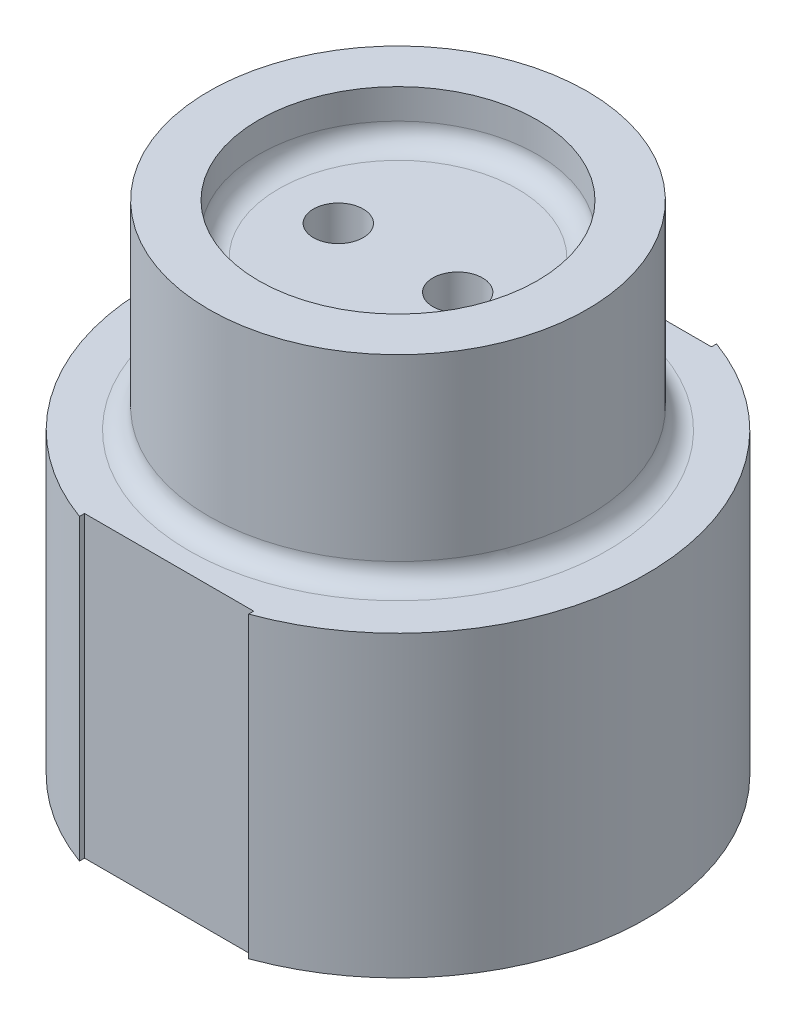
ISO-10303-21;
HEADER;
FILE_DESCRIPTION(('STEP AP214'),'2;1');
FILE_NAME('part.step','',(''),(''),'','','');
FILE_SCHEMA(('AUTOMOTIVE_DESIGN { 1 0 10303 214 1 1 1 1 }'));
ENDSEC;
DATA;
#1=APPLICATION_CONTEXT('core data for automotive mechanical design processes');
#2=APPLICATION_PROTOCOL_DEFINITION('international standard','automotive_design',2000,#1);
#3=PRODUCT_CONTEXT('',#1,'mechanical');
#4=PRODUCT('Part','Part','',(#3));
#5=PRODUCT_RELATED_PRODUCT_CATEGORY('part','',(#4));
#6=PRODUCT_DEFINITION_FORMATION('','',#4);
#7=PRODUCT_DEFINITION_CONTEXT('part definition',#1,'design');
#8=PRODUCT_DEFINITION('design','',#6,#7);
#9=PRODUCT_DEFINITION_SHAPE('','',#8);
#10=(LENGTH_UNIT() NAMED_UNIT(*) SI_UNIT(.MILLI.,.METRE.));
#11=(NAMED_UNIT(*) PLANE_ANGLE_UNIT() SI_UNIT($,.RADIAN.));
#12=(NAMED_UNIT(*) SI_UNIT($,.STERADIAN.) SOLID_ANGLE_UNIT());
#13=UNCERTAINTY_MEASURE_WITH_UNIT(LENGTH_MEASURE(1.E-05),#10,'distance_accuracy_value','');
#14=(GEOMETRIC_REPRESENTATION_CONTEXT(3) GLOBAL_UNCERTAINTY_ASSIGNED_CONTEXT((#13)) GLOBAL_UNIT_ASSIGNED_CONTEXT((#10,
#11,#12)) REPRESENTATION_CONTEXT('',''));
#15=CARTESIAN_POINT('',(0.,0.,0.));
#16=DIRECTION('',(0.,0.,1.));
#17=DIRECTION('',(1.,0.,0.));
#18=AXIS2_PLACEMENT_3D('',#15,#16,#17);
#19=CARTESIAN_POINT('',(0.,0.,0.));
#20=DIRECTION('',(0.,1.,0.));
#21=DIRECTION('',(0.,0.,1.));
#22=AXIS2_PLACEMENT_3D('',#19,#20,#21);
#23=PLANE('',#22);
#24=CARTESIAN_POINT('',(33.02,0.,0.));
#25=DIRECTION('',(0.,1.,0.));
#26=DIRECTION('',(0.,0.,1.));
#27=AXIS2_PLACEMENT_3D('',#24,#25,#26);
#28=CIRCLE('',#27,6.35);
#29=CARTESIAN_POINT('',(33.02,0.,6.35));
#30=VERTEX_POINT('',#29);
#31=EDGE_CURVE('E179',#30,#30,#28,.T.);
#32=ORIENTED_EDGE('',*,*,#31,.T.);
#33=EDGE_LOOP('',(#32));
#34=FACE_BOUND('',#33,.T.);
#35=CARTESIAN_POINT('',(-33.02,0.,0.));
#36=DIRECTION('',(0.,-1.,0.));
#37=DIRECTION('',(0.,0.,1.));
#38=AXIS2_PLACEMENT_3D('',#35,#36,#37);
#39=CIRCLE('',#38,6.35);
#40=CARTESIAN_POINT('',(-33.02,0.,6.35));
#41=VERTEX_POINT('',#40);
#42=EDGE_CURVE('E161',#41,#41,#39,.T.);
#43=ORIENTED_EDGE('',*,*,#42,.F.);
#44=EDGE_LOOP('',(#43));
#45=FACE_BOUND('',#44,.T.);
#46=DIRECTION('',(0.,0.,-1.));
#47=VECTOR('',#46,1.);
#48=CARTESIAN_POINT('',(-21.59,0.,-58.42));
#49=LINE('',#48,#47);
#50=CARTESIAN_POINT('',(-21.59,0.,-58.42));
#51=VERTEX_POINT('',#50);
#52=CARTESIAN_POINT('',(-21.59,0.,-59.7170151631844));
#53=VERTEX_POINT('',#52);
#54=EDGE_CURVE('E125',#51,#53,#49,.T.);
#55=ORIENTED_EDGE('',*,*,#54,.F.);
#56=DIRECTION('',(1.,0.,0.));
#57=VECTOR('',#56,1.);
#58=CARTESIAN_POINT('',(-21.59,0.,-58.42));
#59=LINE('',#58,#57);
#60=CARTESIAN_POINT('',(21.59,0.,-58.42));
#61=VERTEX_POINT('',#60);
#62=EDGE_CURVE('E110',#51,#61,#59,.T.);
#63=ORIENTED_EDGE('',*,*,#62,.T.);
#64=DIRECTION('',(0.,0.,-1.));
#65=VECTOR('',#64,1.);
#66=CARTESIAN_POINT('',(21.59,0.,-58.42));
#67=LINE('',#66,#65);
#68=CARTESIAN_POINT('',(21.59,0.,-59.7170151631844));
#69=VERTEX_POINT('',#68);
#70=EDGE_CURVE('E108',#61,#69,#67,.T.);
#71=ORIENTED_EDGE('',*,*,#70,.T.);
#72=CARTESIAN_POINT('',(0.,0.,0.));
#73=DIRECTION('',(0.,1.,0.));
#74=DIRECTION('',(0.,0.,1.));
#75=AXIS2_PLACEMENT_3D('',#72,#73,#74);
#76=CIRCLE('',#75,63.5);
#77=CARTESIAN_POINT('',(21.59,0.,59.7170151631844));
#78=VERTEX_POINT('',#77);
#79=EDGE_CURVE('E217',#78,#69,#76,.T.);
#80=ORIENTED_EDGE('',*,*,#79,.F.);
#81=DIRECTION('',(0.,0.,1.));
#82=VECTOR('',#81,1.);
#83=CARTESIAN_POINT('',(21.59,0.,58.42));
#84=LINE('',#83,#82);
#85=CARTESIAN_POINT('',(21.59,0.,58.42));
#86=VERTEX_POINT('',#85);
#87=EDGE_CURVE('E149',#86,#78,#84,.T.);
#88=ORIENTED_EDGE('',*,*,#87,.F.);
#89=DIRECTION('',(1.,0.,0.));
#90=VECTOR('',#89,1.);
#91=CARTESIAN_POINT('',(-21.59,0.,58.42));
#92=LINE('',#91,#90);
#93=CARTESIAN_POINT('',(-21.59,0.,58.42));
#94=VERTEX_POINT('',#93);
#95=EDGE_CURVE('E137',#94,#86,#92,.T.);
#96=ORIENTED_EDGE('',*,*,#95,.F.);
#97=DIRECTION('',(0.,0.,1.));
#98=VECTOR('',#97,1.);
#99=CARTESIAN_POINT('',(-21.59,0.,58.42));
#100=LINE('',#99,#98);
#101=CARTESIAN_POINT('',(-21.59,0.,59.7170151631844));
#102=VERTEX_POINT('',#101);
#103=EDGE_CURVE('E142',#94,#102,#100,.T.);
#104=ORIENTED_EDGE('',*,*,#103,.T.);
#105=EDGE_CURVE('E216',#53,#102,#76,.T.);
#106=ORIENTED_EDGE('',*,*,#105,.F.);
#107=EDGE_LOOP('',(#55,#63,#71,#80,#88,#96,#104,#106));
#108=FACE_BOUND('',#107,.T.);
#109=ADVANCED_FACE('F35',(#34,#45,#108),#23,.F.);
#110=CARTESIAN_POINT('',(0.,12.7,0.));
#111=DIRECTION('',(0.,1.,0.));
#112=DIRECTION('',(0.,0.,1.));
#113=AXIS2_PLACEMENT_3D('',#110,#111,#112);
#114=CYLINDRICAL_SURFACE('',#113,63.5);
#115=DIRECTION('',(0.,1.,0.));
#116=VECTOR('',#115,1.);
#117=CARTESIAN_POINT('',(-21.59,12.7,-59.7170151631844));
#118=LINE('',#117,#116);
#119=CARTESIAN_POINT('',(-21.59,76.2,-59.7170151631844));
#120=VERTEX_POINT('',#119);
#121=EDGE_CURVE('E132',#53,#120,#118,.T.);
#122=ORIENTED_EDGE('',*,*,#121,.F.);
#123=ORIENTED_EDGE('',*,*,#105,.T.);
#124=DIRECTION('',(0.,1.,0.));
#125=VECTOR('',#124,1.);
#126=CARTESIAN_POINT('',(-21.59,12.7,59.7170151631844));
#127=LINE('',#126,#125);
#128=CARTESIAN_POINT('',(-21.59,76.2,59.7170151631844));
#129=VERTEX_POINT('',#128);
#130=EDGE_CURVE('E155',#102,#129,#127,.T.);
#131=ORIENTED_EDGE('',*,*,#130,.T.);
#132=CARTESIAN_POINT('',(0.,76.2,0.));
#133=DIRECTION('',(0.,1.,0.));
#134=DIRECTION('',(0.,0.,1.));
#135=AXIS2_PLACEMENT_3D('',#132,#133,#134);
#136=CIRCLE('',#135,63.5);
#137=EDGE_CURVE('E214',#120,#129,#136,.T.);
#138=ORIENTED_EDGE('',*,*,#137,.F.);
#139=EDGE_LOOP('',(#122,#123,#131,#138));
#140=FACE_BOUND('',#139,.T.);
#141=ADVANCED_FACE('F250',(#140),#114,.T.);
#142=DIRECTION('',(0.,1.,0.));
#143=VECTOR('',#142,1.);
#144=CARTESIAN_POINT('',(21.59,12.7,-59.7170151631844));
#145=LINE('',#144,#143);
#146=CARTESIAN_POINT('',(21.59,76.2,-59.7170151631844));
#147=VERTEX_POINT('',#146);
#148=EDGE_CURVE('E130',#147,#69,#145,.F.);
#149=ORIENTED_EDGE('',*,*,#148,.F.);
#150=CARTESIAN_POINT('',(21.59,76.2,59.7170151631844));
#151=VERTEX_POINT('',#150);
#152=EDGE_CURVE('E122',#151,#147,#136,.T.);
#153=ORIENTED_EDGE('',*,*,#152,.F.);
#154=DIRECTION('',(0.,1.,0.));
#155=VECTOR('',#154,1.);
#156=CARTESIAN_POINT('',(21.59,12.7,59.7170151631844));
#157=LINE('',#156,#155);
#158=EDGE_CURVE('E146',#151,#78,#157,.F.);
#159=ORIENTED_EDGE('',*,*,#158,.T.);
#160=ORIENTED_EDGE('',*,*,#79,.T.);
#161=EDGE_LOOP('',(#149,#153,#159,#160));
#162=FACE_BOUND('',#161,.T.);
#163=ADVANCED_FACE('F257',(#162),#114,.T.);
#164=CARTESIAN_POINT('',(63.5,76.2,0.));
#165=DIRECTION('',(0.,-1.,0.));
#166=DIRECTION('',(0.,0.,-1.));
#167=AXIS2_PLACEMENT_3D('',#164,#165,#166);
#168=PLANE('',#167);
#169=CARTESIAN_POINT('',(0.,76.2,0.));
#170=DIRECTION('',(0.,-1.,0.));
#171=DIRECTION('',(0.,0.,-1.));
#172=AXIS2_PLACEMENT_3D('',#169,#170,#171);
#173=CIRCLE('',#172,53.34);
#174=CARTESIAN_POINT('',(0.,76.2,-53.34));
#175=VERTEX_POINT('',#174);
#176=EDGE_CURVE('E11',#175,#175,#173,.T.);
#177=ORIENTED_EDGE('',*,*,#176,.T.);
#178=EDGE_LOOP('',(#177));
#179=FACE_BOUND('',#178,.T.);
#180=DIRECTION('',(0.,0.,-1.));
#181=VECTOR('',#180,1.);
#182=CARTESIAN_POINT('',(-21.59,76.2,-58.42));
#183=LINE('',#182,#181);
#184=CARTESIAN_POINT('',(-21.59,76.2,-58.42));
#185=VERTEX_POINT('',#184);
#186=EDGE_CURVE('E123',#185,#120,#183,.T.);
#187=ORIENTED_EDGE('',*,*,#186,.T.);
#188=ORIENTED_EDGE('',*,*,#137,.T.);
#189=DIRECTION('',(0.,0.,1.));
#190=VECTOR('',#189,1.);
#191=CARTESIAN_POINT('',(-21.59,76.2,58.42));
#192=LINE('',#191,#190);
#193=CARTESIAN_POINT('',(-21.59,76.2,58.42));
#194=VERTEX_POINT('',#193);
#195=EDGE_CURVE('E143',#194,#129,#192,.T.);
#196=ORIENTED_EDGE('',*,*,#195,.F.);
#197=DIRECTION('',(-1.,0.,0.));
#198=VECTOR('',#197,1.);
#199=CARTESIAN_POINT('',(-21.59,76.2,58.42));
#200=LINE('',#199,#198);
#201=CARTESIAN_POINT('',(21.59,76.2,58.42));
#202=VERTEX_POINT('',#201);
#203=EDGE_CURVE('E140',#202,#194,#200,.T.);
#204=ORIENTED_EDGE('',*,*,#203,.F.);
#205=DIRECTION('',(0.,0.,1.));
#206=VECTOR('',#205,1.);
#207=CARTESIAN_POINT('',(21.59,76.2,58.42));
#208=LINE('',#207,#206);
#209=EDGE_CURVE('E147',#202,#151,#208,.T.);
#210=ORIENTED_EDGE('',*,*,#209,.T.);
#211=ORIENTED_EDGE('',*,*,#152,.T.);
#212=DIRECTION('',(0.,0.,-1.));
#213=VECTOR('',#212,1.);
#214=CARTESIAN_POINT('',(21.59,76.2,-58.42));
#215=LINE('',#214,#213);
#216=CARTESIAN_POINT('',(21.59,76.2,-58.42));
#217=VERTEX_POINT('',#216);
#218=EDGE_CURVE('E105',#217,#147,#215,.T.);
#219=ORIENTED_EDGE('',*,*,#218,.F.);
#220=DIRECTION('',(-1.,0.,0.));
#221=VECTOR('',#220,1.);
#222=CARTESIAN_POINT('',(-21.59,76.2,-58.42));
#223=LINE('',#222,#221);
#224=EDGE_CURVE('E111',#217,#185,#223,.T.);
#225=ORIENTED_EDGE('',*,*,#224,.T.);
#226=EDGE_LOOP('',(#187,#188,#196,#204,#210,#211,#219,#225));
#227=FACE_BOUND('',#226,.T.);
#228=ADVANCED_FACE('F119',(#179,#227),#168,.F.);
#229=CARTESIAN_POINT('',(-15.24,114.3,0.));
#230=DIRECTION('',(0.,-1.,0.));
#231=DIRECTION('',(1.,0.,0.));
#232=AXIS2_PLACEMENT_3D('',#229,#230,#231);
#233=CYLINDRICAL_SURFACE('',#232,6.35);
#234=CARTESIAN_POINT('',(-15.24,50.8,0.));
#235=DIRECTION('',(-0.707106781186548,-0.707106781186548,0.));
#236=DIRECTION('',(0.707106781186548,-0.707106781186548,0.));
#237=AXIS2_PLACEMENT_3D('',#234,#235,#236);
#238=ELLIPSE('',#237,8.98025612106916,6.35);
#239=CARTESIAN_POINT('',(-8.89,44.45,0.));
#240=VERTEX_POINT('',#239);
#241=EDGE_CURVE('E165',#240,#240,#238,.F.);
#242=ORIENTED_EDGE('',*,*,#241,.F.);
#243=EDGE_LOOP('',(#242));
#244=FACE_BOUND('',#243,.T.);
#245=CARTESIAN_POINT('',(-15.24,114.3,0.));
#246=DIRECTION('',(0.,1.,0.));
#247=DIRECTION('',(0.,0.,1.));
#248=AXIS2_PLACEMENT_3D('',#245,#246,#247);
#249=CIRCLE('',#248,6.35000000000001);
#250=CARTESIAN_POINT('',(-15.24,114.3,6.35000000000001));
#251=VERTEX_POINT('',#250);
#252=EDGE_CURVE('E158',#251,#251,#249,.T.);
#253=ORIENTED_EDGE('',*,*,#252,.T.);
#254=EDGE_LOOP('',(#253));
#255=FACE_BOUND('',#254,.T.);
#256=ADVANCED_FACE('F264',(#244,#255),#233,.F.);
#257=CARTESIAN_POINT('',(-1.16999999999999,50.8,0.));
#258=DIRECTION('',(-1.,0.,0.));
#259=DIRECTION('',(0.,0.,1.));
#260=AXIS2_PLACEMENT_3D('',#257,#258,#259);
#261=CYLINDRICAL_SURFACE('',#260,6.35);
#262=ORIENTED_EDGE('',*,*,#241,.T.);
#263=EDGE_LOOP('',(#262));
#264=FACE_BOUND('',#263,.T.);
#265=CARTESIAN_POINT('',(-33.02,50.8,0.));
#266=DIRECTION('',(-0.707106781186548,-0.707106781186548,0.));
#267=DIRECTION('',(-0.707106781186548,0.707106781186548,0.));
#268=AXIS2_PLACEMENT_3D('',#265,#266,#267);
#269=ELLIPSE('',#268,8.98025612106916,6.35);
#270=CARTESIAN_POINT('',(-39.37,57.15,0.));
#271=VERTEX_POINT('',#270);
#272=EDGE_CURVE('E169',#271,#271,#269,.F.);
#273=ORIENTED_EDGE('',*,*,#272,.F.);
#274=EDGE_LOOP('',(#273));
#275=FACE_BOUND('',#274,.T.);
#276=ADVANCED_FACE('F338',(#264,#275),#261,.F.);
#277=CARTESIAN_POINT('',(-33.02,64.87,0.));
#278=DIRECTION('',(0.,-1.,0.));
#279=DIRECTION('',(0.,0.,-1.));
#280=AXIS2_PLACEMENT_3D('',#277,#278,#279);
#281=CYLINDRICAL_SURFACE('',#280,6.35);
#282=ORIENTED_EDGE('',*,*,#272,.T.);
#283=EDGE_LOOP('',(#282));
#284=FACE_BOUND('',#283,.T.);
#285=ORIENTED_EDGE('',*,*,#42,.T.);
#286=EDGE_LOOP('',(#285));
#287=FACE_BOUND('',#286,.T.);
#288=ADVANCED_FACE('F269',(#284,#287),#281,.F.);
#289=CARTESIAN_POINT('',(0.,12.7,0.));
#290=DIRECTION('',(0.,1.,0.));
#291=DIRECTION('',(0.,0.,1.));
#292=AXIS2_PLACEMENT_3D('',#289,#290,#291);
#293=CYLINDRICAL_SURFACE('',#292,48.26);
#294=CARTESIAN_POINT('',(0.,81.28,0.));
#295=DIRECTION('',(0.,-1.,0.));
#296=DIRECTION('',(0.,0.,-1.));
#297=AXIS2_PLACEMENT_3D('',#294,#295,#296);
#298=CIRCLE('',#297,48.26);
#299=CARTESIAN_POINT('',(0.,81.28,-48.26));
#300=VERTEX_POINT('',#299);
#301=EDGE_CURVE('E44',#300,#300,#298,.F.);
#302=ORIENTED_EDGE('',*,*,#301,.T.);
#303=EDGE_LOOP('',(#302));
#304=FACE_BOUND('',#303,.T.);
#305=CARTESIAN_POINT('',(0.,127.,0.));
#306=DIRECTION('',(0.,1.,0.));
#307=DIRECTION('',(0.,0.,1.));
#308=AXIS2_PLACEMENT_3D('',#305,#306,#307);
#309=CIRCLE('',#308,48.26);
#310=CARTESIAN_POINT('',(0.,127.,48.26));
#311=VERTEX_POINT('',#310);
#312=EDGE_CURVE('E211',#311,#311,#309,.T.);
#313=ORIENTED_EDGE('',*,*,#312,.F.);
#314=EDGE_LOOP('',(#313));
#315=FACE_BOUND('',#314,.T.);
#316=ADVANCED_FACE('F238',(#304,#315),#293,.T.);
#317=CARTESIAN_POINT('',(48.26,127.,0.));
#318=DIRECTION('',(0.,-1.,0.));
#319=DIRECTION('',(0.,0.,-1.));
#320=AXIS2_PLACEMENT_3D('',#317,#318,#319);
#321=PLANE('',#320);
#322=CARTESIAN_POINT('',(0.,127.,0.));
#323=DIRECTION('',(0.,1.,0.));
#324=DIRECTION('',(0.,0.,1.));
#325=AXIS2_PLACEMENT_3D('',#322,#323,#324);
#326=CIRCLE('',#325,35.56);
#327=CARTESIAN_POINT('',(0.,127.,35.56));
#328=VERTEX_POINT('',#327);
#329=EDGE_CURVE('E208',#328,#328,#326,.T.);
#330=ORIENTED_EDGE('',*,*,#329,.F.);
#331=EDGE_LOOP('',(#330));
#332=FACE_BOUND('',#331,.T.);
#333=ORIENTED_EDGE('',*,*,#312,.T.);
#334=EDGE_LOOP('',(#333));
#335=FACE_BOUND('',#334,.T.);
#336=ADVANCED_FACE('F268',(#332,#335),#321,.F.);
#337=CARTESIAN_POINT('',(0.,12.7,0.));
#338=DIRECTION('',(0.,1.,0.));
#339=DIRECTION('',(0.,0.,1.));
#340=AXIS2_PLACEMENT_3D('',#337,#338,#339);
#341=CYLINDRICAL_SURFACE('',#340,35.56);
#342=CARTESIAN_POINT('',(0.,119.38,0.));
#343=DIRECTION('',(0.,1.,0.));
#344=DIRECTION('',(0.,0.,1.));
#345=AXIS2_PLACEMENT_3D('',#342,#343,#344);
#346=CIRCLE('',#345,35.56);
#347=CARTESIAN_POINT('',(0.,119.38,35.56));
#348=VERTEX_POINT('',#347);
#349=EDGE_CURVE('E233',#348,#348,#346,.F.);
#350=ORIENTED_EDGE('',*,*,#349,.T.);
#351=EDGE_LOOP('',(#350));
#352=FACE_BOUND('',#351,.T.);
#353=ORIENTED_EDGE('',*,*,#329,.T.);
#354=EDGE_LOOP('',(#353));
#355=FACE_BOUND('',#354,.T.);
#356=ADVANCED_FACE('F272',(#352,#355),#341,.F.);
#357=CARTESIAN_POINT('',(0.,114.3,0.));
#358=DIRECTION('',(0.,1.,0.));
#359=DIRECTION('',(0.,0.,1.));
#360=AXIS2_PLACEMENT_3D('',#357,#358,#359);
#361=PLANE('',#360);
#362=CARTESIAN_POINT('',(0.,114.3,0.));
#363=DIRECTION('',(0.,1.,0.));
#364=DIRECTION('',(0.,0.,1.));
#365=AXIS2_PLACEMENT_3D('',#362,#363,#364);
#366=CIRCLE('',#365,30.48);
#367=CARTESIAN_POINT('',(0.,114.3,30.48));
#368=VERTEX_POINT('',#367);
#369=EDGE_CURVE('E230',#368,#368,#366,.T.);
#370=ORIENTED_EDGE('',*,*,#369,.T.);
#371=EDGE_LOOP('',(#370));
#372=FACE_BOUND('',#371,.T.);
#373=ORIENTED_EDGE('',*,*,#252,.F.);
#374=EDGE_LOOP('',(#373));
#375=FACE_BOUND('',#374,.T.);
#376=CARTESIAN_POINT('',(15.24,114.3,0.));
#377=DIRECTION('',(0.,1.,0.));
#378=DIRECTION('',(0.,0.,1.));
#379=AXIS2_PLACEMENT_3D('',#376,#377,#378);
#380=CIRCLE('',#379,6.35000000000001);
#381=CARTESIAN_POINT('',(15.24,114.3,6.35000000000001));
#382=VERTEX_POINT('',#381);
#383=EDGE_CURVE('E168',#382,#382,#380,.F.);
#384=ORIENTED_EDGE('',*,*,#383,.T.);
#385=EDGE_LOOP('',(#384));
#386=FACE_BOUND('',#385,.T.);
#387=ADVANCED_FACE('F276',(#372,#375,#386),#361,.T.);
#388=CARTESIAN_POINT('',(33.02,64.87,0.));
#389=DIRECTION('',(0.,-1.,0.));
#390=DIRECTION('',(0.,0.,-1.));
#391=AXIS2_PLACEMENT_3D('',#388,#389,#390);
#392=CYLINDRICAL_SURFACE('',#391,6.35);
#393=CARTESIAN_POINT('',(33.02,50.8,0.));
#394=DIRECTION('',(0.707106781186548,-0.707106781186548,0.));
#395=DIRECTION('',(0.707106781186548,0.707106781186548,0.));
#396=AXIS2_PLACEMENT_3D('',#393,#394,#395);
#397=ELLIPSE('',#396,8.98025612106916,6.35);
#398=CARTESIAN_POINT('',(39.37,57.15,0.));
#399=VERTEX_POINT('',#398);
#400=EDGE_CURVE('E187',#399,#399,#397,.F.);
#401=ORIENTED_EDGE('',*,*,#400,.T.);
#402=EDGE_LOOP('',(#401));
#403=FACE_BOUND('',#402,.T.);
#404=ORIENTED_EDGE('',*,*,#31,.F.);
#405=EDGE_LOOP('',(#404));
#406=FACE_BOUND('',#405,.T.);
#407=ADVANCED_FACE('F295',(#403,#406),#392,.F.);
#408=CARTESIAN_POINT('',(1.16999999999999,50.8,0.));
#409=DIRECTION('',(1.,0.,0.));
#410=DIRECTION('',(0.,0.,-1.));
#411=AXIS2_PLACEMENT_3D('',#408,#409,#410);
#412=CYLINDRICAL_SURFACE('',#411,6.35);
#413=CARTESIAN_POINT('',(15.24,50.8,0.));
#414=DIRECTION('',(0.707106781186548,-0.707106781186548,0.));
#415=DIRECTION('',(-0.707106781186548,-0.707106781186548,0.));
#416=AXIS2_PLACEMENT_3D('',#413,#414,#415);
#417=ELLIPSE('',#416,8.98025612106916,6.35);
#418=CARTESIAN_POINT('',(8.89,44.45,0.));
#419=VERTEX_POINT('',#418);
#420=EDGE_CURVE('E183',#419,#419,#417,.F.);
#421=ORIENTED_EDGE('',*,*,#420,.T.);
#422=EDGE_LOOP('',(#421));
#423=FACE_BOUND('',#422,.T.);
#424=ORIENTED_EDGE('',*,*,#400,.F.);
#425=EDGE_LOOP('',(#424));
#426=FACE_BOUND('',#425,.T.);
#427=ADVANCED_FACE('F315',(#423,#426),#412,.F.);
#428=CARTESIAN_POINT('',(15.24,114.3,0.));
#429=DIRECTION('',(0.,-1.,0.));
#430=DIRECTION('',(1.,0.,0.));
#431=AXIS2_PLACEMENT_3D('',#428,#429,#430);
#432=CYLINDRICAL_SURFACE('',#431,6.35);
#433=ORIENTED_EDGE('',*,*,#420,.F.);
#434=EDGE_LOOP('',(#433));
#435=FACE_BOUND('',#434,.T.);
#436=ORIENTED_EDGE('',*,*,#383,.F.);
#437=EDGE_LOOP('',(#436));
#438=FACE_BOUND('',#437,.T.);
#439=ADVANCED_FACE('F319',(#435,#438),#432,.F.);
#440=CARTESIAN_POINT('',(-21.59,0.,58.42));
#441=DIRECTION('',(-1.,0.,0.));
#442=DIRECTION('',(0.,0.,1.));
#443=AXIS2_PLACEMENT_3D('',#440,#441,#442);
#444=PLANE('',#443);
#445=ORIENTED_EDGE('',*,*,#103,.F.);
#446=DIRECTION('',(0.,-1.,0.));
#447=VECTOR('',#446,1.);
#448=CARTESIAN_POINT('',(-21.59,0.,58.42));
#449=LINE('',#448,#447);
#450=EDGE_CURVE('E134',#194,#94,#449,.T.);
#451=ORIENTED_EDGE('',*,*,#450,.F.);
#452=ORIENTED_EDGE('',*,*,#195,.T.);
#453=ORIENTED_EDGE('',*,*,#130,.F.);
#454=EDGE_LOOP('',(#445,#451,#452,#453));
#455=FACE_BOUND('',#454,.T.);
#456=ADVANCED_FACE('F323',(#455),#444,.F.);
#457=CARTESIAN_POINT('',(21.59,0.,58.42));
#458=DIRECTION('',(1.,0.,0.));
#459=DIRECTION('',(0.,1.,0.));
#460=AXIS2_PLACEMENT_3D('',#457,#458,#459);
#461=PLANE('',#460);
#462=ORIENTED_EDGE('',*,*,#209,.F.);
#463=DIRECTION('',(0.,1.,0.));
#464=VECTOR('',#463,1.);
#465=CARTESIAN_POINT('',(21.59,0.,58.42));
#466=LINE('',#465,#464);
#467=EDGE_CURVE('E59',#86,#202,#466,.T.);
#468=ORIENTED_EDGE('',*,*,#467,.F.);
#469=ORIENTED_EDGE('',*,*,#87,.T.);
#470=ORIENTED_EDGE('',*,*,#158,.F.);
#471=EDGE_LOOP('',(#462,#468,#469,#470));
#472=FACE_BOUND('',#471,.T.);
#473=ADVANCED_FACE('F348',(#472),#461,.F.);
#474=CARTESIAN_POINT('',(0.,0.,58.42));
#475=DIRECTION('',(0.,0.,-1.));
#476=DIRECTION('',(-1.,0.,0.));
#477=AXIS2_PLACEMENT_3D('',#474,#475,#476);
#478=PLANE('',#477);
#479=ORIENTED_EDGE('',*,*,#450,.T.);
#480=ORIENTED_EDGE('',*,*,#95,.T.);
#481=ORIENTED_EDGE('',*,*,#467,.T.);
#482=ORIENTED_EDGE('',*,*,#203,.T.);
#483=EDGE_LOOP('',(#479,#480,#481,#482));
#484=FACE_BOUND('',#483,.T.);
#485=ADVANCED_FACE('F352',(#484),#478,.F.);
#486=CARTESIAN_POINT('',(-21.59,0.,-58.42));
#487=DIRECTION('',(1.,0.,0.));
#488=DIRECTION('',(0.,0.,-1.));
#489=AXIS2_PLACEMENT_3D('',#486,#487,#488);
#490=PLANE('',#489);
#491=ORIENTED_EDGE('',*,*,#121,.T.);
#492=ORIENTED_EDGE('',*,*,#186,.F.);
#493=DIRECTION('',(0.,-1.,0.));
#494=VECTOR('',#493,1.);
#495=CARTESIAN_POINT('',(-21.59,0.,-58.42));
#496=LINE('',#495,#494);
#497=EDGE_CURVE('E51',#185,#51,#496,.T.);
#498=ORIENTED_EDGE('',*,*,#497,.T.);
#499=ORIENTED_EDGE('',*,*,#54,.T.);
#500=EDGE_LOOP('',(#491,#492,#498,#499));
#501=FACE_BOUND('',#500,.T.);
#502=ADVANCED_FACE('F356',(#501),#490,.T.);
#503=CARTESIAN_POINT('',(21.59,0.,-58.42));
#504=DIRECTION('',(-1.,0.,0.));
#505=DIRECTION('',(0.,-1.,0.));
#506=AXIS2_PLACEMENT_3D('',#503,#504,#505);
#507=PLANE('',#506);
#508=ORIENTED_EDGE('',*,*,#148,.T.);
#509=ORIENTED_EDGE('',*,*,#70,.F.);
#510=DIRECTION('',(0.,1.,0.));
#511=VECTOR('',#510,1.);
#512=CARTESIAN_POINT('',(21.59,0.,-58.42));
#513=LINE('',#512,#511);
#514=EDGE_CURVE('E102',#61,#217,#513,.T.);
#515=ORIENTED_EDGE('',*,*,#514,.T.);
#516=ORIENTED_EDGE('',*,*,#218,.T.);
#517=EDGE_LOOP('',(#508,#509,#515,#516));
#518=FACE_BOUND('',#517,.T.);
#519=ADVANCED_FACE('F103',(#518),#507,.T.);
#520=CARTESIAN_POINT('',(0.,0.,-58.42));
#521=DIRECTION('',(0.,0.,1.));
#522=DIRECTION('',(-1.,0.,0.));
#523=AXIS2_PLACEMENT_3D('',#520,#521,#522);
#524=PLANE('',#523);
#525=ORIENTED_EDGE('',*,*,#497,.F.);
#526=ORIENTED_EDGE('',*,*,#224,.F.);
#527=ORIENTED_EDGE('',*,*,#514,.F.);
#528=ORIENTED_EDGE('',*,*,#62,.F.);
#529=EDGE_LOOP('',(#525,#526,#527,#528));
#530=FACE_BOUND('',#529,.T.);
#531=ADVANCED_FACE('F114',(#530),#524,.F.);
#532=CARTESIAN_POINT('',(0.,119.38,0.));
#533=DIRECTION('',(0.,1.,0.));
#534=DIRECTION('',(0.,0.,1.));
#535=AXIS2_PLACEMENT_3D('',#532,#533,#534);
#536=TOROIDAL_SURFACE('',#535,30.48,5.08);
#537=ORIENTED_EDGE('',*,*,#349,.F.);
#538=EDGE_LOOP('',(#537));
#539=FACE_BOUND('',#538,.T.);
#540=ORIENTED_EDGE('',*,*,#369,.F.);
#541=EDGE_LOOP('',(#540));
#542=FACE_BOUND('',#541,.T.);
#543=ADVANCED_FACE('F242',(#539,#542),#536,.F.);
#544=CARTESIAN_POINT('',(0.,81.28,0.));
#545=DIRECTION('',(0.,-1.,0.));
#546=DIRECTION('',(0.,0.,-1.));
#547=AXIS2_PLACEMENT_3D('',#544,#545,#546);
#548=TOROIDAL_SURFACE('',#547,53.34,5.08);
#549=ORIENTED_EDGE('',*,*,#176,.F.);
#550=EDGE_LOOP('',(#549));
#551=FACE_BOUND('',#550,.T.);
#552=ORIENTED_EDGE('',*,*,#301,.F.);
#553=EDGE_LOOP('',(#552));
#554=FACE_BOUND('',#553,.T.);
#555=ADVANCED_FACE('F37',(#551,#554),#548,.F.);
#556=CLOSED_SHELL('',(#109,#141,#163,#228,#256,#276,#288,#316,#336,#356,#387,#407,#427,#439,
#456,#473,#485,#502,#519,#531,#543,#555));
#557=CARTESIAN_POINT('',(0.,106.68,0.));
#558=DIRECTION('',(0.,1.,0.));
#559=DIRECTION('',(0.,0.,1.));
#560=AXIS2_PLACEMENT_3D('',#557,#558,#559);
#561=PLANE('',#560);
#562=CARTESIAN_POINT('',(15.24,106.68,0.));
#563=DIRECTION('',(0.,1.,0.));
#564=DIRECTION('',(0.,0.,1.));
#565=AXIS2_PLACEMENT_3D('',#562,#563,#564);
#566=CIRCLE('',#565,8.89000000000001);
#567=CARTESIAN_POINT('',(15.24,106.68,8.89000000000001));
#568=VERTEX_POINT('',#567);
#569=EDGE_CURVE('E195',#568,#568,#566,.F.);
#570=ORIENTED_EDGE('',*,*,#569,.F.);
#571=EDGE_LOOP('',(#570));
#572=FACE_BOUND('',#571,.T.);
#573=CARTESIAN_POINT('',(0.,106.68,0.));
#574=DIRECTION('',(0.,1.,0.));
#575=DIRECTION('',(0.,0.,1.));
#576=AXIS2_PLACEMENT_3D('',#573,#574,#575);
#577=CIRCLE('',#576,35.56);
#578=CARTESIAN_POINT('',(0.,106.68,35.56));
#579=VERTEX_POINT('',#578);
#580=EDGE_CURVE('E220',#579,#579,#577,.F.);
#581=ORIENTED_EDGE('',*,*,#580,.T.);
#582=EDGE_LOOP('',(#581));
#583=FACE_BOUND('',#582,.T.);
#584=CARTESIAN_POINT('',(-15.24,106.68,0.));
#585=DIRECTION('',(0.,1.,0.));
#586=DIRECTION('',(0.,0.,1.));
#587=AXIS2_PLACEMENT_3D('',#584,#585,#586);
#588=CIRCLE('',#587,8.89000000000001);
#589=CARTESIAN_POINT('',(-15.24,106.68,8.89000000000001));
#590=VERTEX_POINT('',#589);
#591=EDGE_CURVE('E227',#590,#590,#588,.F.);
#592=ORIENTED_EDGE('',*,*,#591,.F.);
#593=EDGE_LOOP('',(#592));
#594=FACE_BOUND('',#593,.T.);
#595=ADVANCED_FACE('F291',(#572,#583,#594),#561,.F.);
#596=CARTESIAN_POINT('',(0.,12.7,0.));
#597=DIRECTION('',(0.,-1.,0.));
#598=DIRECTION('',(0.,0.,-1.));
#599=AXIS2_PLACEMENT_3D('',#596,#597,#598);
#600=PLANE('',#599);
#601=CARTESIAN_POINT('',(0.,12.7,0.));
#602=DIRECTION('',(0.,1.,0.));
#603=DIRECTION('',(0.,0.,1.));
#604=AXIS2_PLACEMENT_3D('',#601,#602,#603);
#605=CIRCLE('',#604,50.8);
#606=CARTESIAN_POINT('',(0.,12.7,50.8));
#607=VERTEX_POINT('',#606);
#608=EDGE_CURVE('E186',#607,#607,#605,.T.);
#609=ORIENTED_EDGE('',*,*,#608,.T.);
#610=EDGE_LOOP('',(#609));
#611=FACE_BOUND('',#610,.T.);
#612=CARTESIAN_POINT('',(33.02,12.7,0.));
#613=DIRECTION('',(0.,1.,0.));
#614=DIRECTION('',(0.,0.,1.));
#615=AXIS2_PLACEMENT_3D('',#612,#613,#614);
#616=CIRCLE('',#615,8.89000000000001);
#617=CARTESIAN_POINT('',(33.02,12.7,8.89000000000001));
#618=VERTEX_POINT('',#617);
#619=EDGE_CURVE('E191',#618,#618,#616,.T.);
#620=ORIENTED_EDGE('',*,*,#619,.F.);
#621=EDGE_LOOP('',(#620));
#622=FACE_BOUND('',#621,.T.);
#623=CARTESIAN_POINT('',(-33.02,12.7,0.));
#624=DIRECTION('',(0.,-1.,0.));
#625=DIRECTION('',(0.,0.,-1.));
#626=AXIS2_PLACEMENT_3D('',#623,#624,#625);
#627=CIRCLE('',#626,8.89000000000001);
#628=CARTESIAN_POINT('',(-33.02,12.7,-8.89000000000001));
#629=VERTEX_POINT('',#628);
#630=EDGE_CURVE('E194',#629,#629,#627,.F.);
#631=ORIENTED_EDGE('',*,*,#630,.F.);
#632=EDGE_LOOP('',(#631));
#633=FACE_BOUND('',#632,.T.);
#634=ADVANCED_FACE('F287',(#611,#622,#633),#600,.F.);
#635=CARTESIAN_POINT('',(0.,12.7,0.));
#636=DIRECTION('',(0.,1.,0.));
#637=DIRECTION('',(0.,0.,1.));
#638=AXIS2_PLACEMENT_3D('',#635,#636,#637);
#639=CYLINDRICAL_SURFACE('',#638,50.8);
#640=ORIENTED_EDGE('',*,*,#608,.F.);
#641=EDGE_LOOP('',(#640));
#642=FACE_BOUND('',#641,.T.);
#643=CARTESIAN_POINT('',(0.,63.5,0.));
#644=DIRECTION('',(0.,1.,0.));
#645=DIRECTION('',(0.,0.,1.));
#646=AXIS2_PLACEMENT_3D('',#643,#644,#645);
#647=CIRCLE('',#646,50.8);
#648=CARTESIAN_POINT('',(0.,63.5,50.8));
#649=VERTEX_POINT('',#648);
#650=EDGE_CURVE('E202',#649,#649,#647,.T.);
#651=ORIENTED_EDGE('',*,*,#650,.T.);
#652=EDGE_LOOP('',(#651));
#653=FACE_BOUND('',#652,.T.);
#654=ADVANCED_FACE('F282',(#642,#653),#639,.F.);
#655=CARTESIAN_POINT('',(50.8,63.5,0.));
#656=DIRECTION('',(0.,1.,0.));
#657=DIRECTION('',(0.,0.,1.));
#658=AXIS2_PLACEMENT_3D('',#655,#656,#657);
#659=PLANE('',#658);
#660=ORIENTED_EDGE('',*,*,#650,.F.);
#661=EDGE_LOOP('',(#660));
#662=FACE_BOUND('',#661,.T.);
#663=CARTESIAN_POINT('',(0.,63.5,0.));
#664=DIRECTION('',(0.,1.,0.));
#665=DIRECTION('',(0.,0.,1.));
#666=AXIS2_PLACEMENT_3D('',#663,#664,#665);
#667=CIRCLE('',#666,35.56);
#668=CARTESIAN_POINT('',(0.,63.5,35.56));
#669=VERTEX_POINT('',#668);
#670=EDGE_CURVE('E205',#669,#669,#667,.T.);
#671=ORIENTED_EDGE('',*,*,#670,.T.);
#672=EDGE_LOOP('',(#671));
#673=FACE_BOUND('',#672,.T.);
#674=ADVANCED_FACE('F279',(#662,#673),#659,.F.);
#675=ORIENTED_EDGE('',*,*,#670,.F.);
#676=EDGE_LOOP('',(#675));
#677=FACE_BOUND('',#676,.T.);
#678=ORIENTED_EDGE('',*,*,#580,.F.);
#679=EDGE_LOOP('',(#678));
#680=FACE_BOUND('',#679,.T.);
#681=ADVANCED_FACE('F278',(#677,#680),#341,.F.);
#682=CARTESIAN_POINT('',(15.24,114.3,0.));
#683=DIRECTION('',(0.,-1.,0.));
#684=DIRECTION('',(1.,0.,0.));
#685=AXIS2_PLACEMENT_3D('',#682,#683,#684);
#686=CYLINDRICAL_SURFACE('',#685,8.89000000000001);
#687=CARTESIAN_POINT('',(15.24,50.8,0.));
#688=DIRECTION('',(0.707106781186548,-0.707106781186548,0.));
#689=DIRECTION('',(-0.707106781186548,-0.707106781186548,0.));
#690=AXIS2_PLACEMENT_3D('',#687,#688,#689);
#691=ELLIPSE('',#690,12.5723585694968,8.89000000000001);
#692=CARTESIAN_POINT('',(6.35,41.91,0.));
#693=VERTEX_POINT('',#692);
#694=EDGE_CURVE('E190',#693,#693,#691,.T.);
#695=ORIENTED_EDGE('',*,*,#694,.F.);
#696=EDGE_LOOP('',(#695));
#697=FACE_BOUND('',#696,.T.);
#698=ORIENTED_EDGE('',*,*,#569,.T.);
#699=EDGE_LOOP('',(#698));
#700=FACE_BOUND('',#699,.T.);
#701=ADVANCED_FACE('F304',(#697,#700),#686,.T.);
#702=CARTESIAN_POINT('',(33.02,70.458,0.));
#703=DIRECTION('',(0.,-1.,0.));
#704=DIRECTION('',(0.,0.,-1.));
#705=AXIS2_PLACEMENT_3D('',#702,#703,#704);
#706=CYLINDRICAL_SURFACE('',#705,8.89000000000001);
#707=CARTESIAN_POINT('',(33.02,50.8,0.));
#708=DIRECTION('',(0.707106781186547,-0.707106781186547,0.));
#709=DIRECTION('',(0.707106781186548,0.707106781186548,0.));
#710=AXIS2_PLACEMENT_3D('',#707,#708,#709);
#711=ELLIPSE('',#710,12.5723585694968,8.89000000000001);
#712=CARTESIAN_POINT('',(41.91,59.69,0.));
#713=VERTEX_POINT('',#712);
#714=EDGE_CURVE('E182',#713,#713,#711,.T.);
#715=ORIENTED_EDGE('',*,*,#714,.T.);
#716=EDGE_LOOP('',(#715));
#717=FACE_BOUND('',#716,.T.);
#718=ORIENTED_EDGE('',*,*,#619,.T.);
#719=EDGE_LOOP('',(#718));
#720=FACE_BOUND('',#719,.T.);
#721=ADVANCED_FACE('F300',(#717,#720),#706,.T.);
#722=CARTESIAN_POINT('',(-4.41800000000002,50.8,0.));
#723=DIRECTION('',(1.,0.,0.));
#724=DIRECTION('',(0.,0.,-1.));
#725=AXIS2_PLACEMENT_3D('',#722,#723,#724);
#726=CYLINDRICAL_SURFACE('',#725,8.89000000000001);
#727=ORIENTED_EDGE('',*,*,#694,.T.);
#728=EDGE_LOOP('',(#727));
#729=FACE_BOUND('',#728,.T.);
#730=ORIENTED_EDGE('',*,*,#714,.F.);
#731=EDGE_LOOP('',(#730));
#732=FACE_BOUND('',#731,.T.);
#733=ADVANCED_FACE('F303',(#729,#732),#726,.T.);
#734=CARTESIAN_POINT('',(-15.24,114.3,0.));
#735=DIRECTION('',(0.,-1.,0.));
#736=DIRECTION('',(1.,0.,0.));
#737=AXIS2_PLACEMENT_3D('',#734,#735,#736);
#738=CYLINDRICAL_SURFACE('',#737,8.89000000000001);
#739=CARTESIAN_POINT('',(-15.24,50.8,0.));
#740=DIRECTION('',(-0.707106781186548,-0.707106781186548,0.));
#741=DIRECTION('',(0.707106781186548,-0.707106781186548,0.));
#742=AXIS2_PLACEMENT_3D('',#739,#740,#741);
#743=ELLIPSE('',#742,12.5723585694968,8.89000000000001);
#744=CARTESIAN_POINT('',(-6.35,41.91,0.));
#745=VERTEX_POINT('',#744);
#746=EDGE_CURVE('E172',#745,#745,#743,.T.);
#747=ORIENTED_EDGE('',*,*,#746,.F.);
#748=EDGE_LOOP('',(#747));
#749=FACE_BOUND('',#748,.T.);
#750=ORIENTED_EDGE('',*,*,#591,.T.);
#751=EDGE_LOOP('',(#750));
#752=FACE_BOUND('',#751,.T.);
#753=ADVANCED_FACE('F306',(#749,#752),#738,.T.);
#754=CARTESIAN_POINT('',(-33.02,70.458,0.));
#755=DIRECTION('',(0.,-1.,0.));
#756=DIRECTION('',(0.,0.,-1.));
#757=AXIS2_PLACEMENT_3D('',#754,#755,#756);
#758=CYLINDRICAL_SURFACE('',#757,8.89000000000001);
#759=CARTESIAN_POINT('',(-33.02,50.8,0.));
#760=DIRECTION('',(-0.707106781186547,-0.707106781186547,0.));
#761=DIRECTION('',(-0.707106781186548,0.707106781186548,0.));
#762=AXIS2_PLACEMENT_3D('',#759,#760,#761);
#763=ELLIPSE('',#762,12.5723585694968,8.89000000000001);
#764=CARTESIAN_POINT('',(-41.91,59.69,0.));
#765=VERTEX_POINT('',#764);
#766=EDGE_CURVE('E164',#765,#765,#763,.T.);
#767=ORIENTED_EDGE('',*,*,#766,.T.);
#768=EDGE_LOOP('',(#767));
#769=FACE_BOUND('',#768,.T.);
#770=ORIENTED_EDGE('',*,*,#630,.T.);
#771=EDGE_LOOP('',(#770));
#772=FACE_BOUND('',#771,.T.);
#773=ADVANCED_FACE('F325',(#769,#772),#758,.T.);
#774=CARTESIAN_POINT('',(4.41800000000002,50.8,0.));
#775=DIRECTION('',(-1.,0.,0.));
#776=DIRECTION('',(0.,0.,1.));
#777=AXIS2_PLACEMENT_3D('',#774,#775,#776);
#778=CYLINDRICAL_SURFACE('',#777,8.89000000000001);
#779=ORIENTED_EDGE('',*,*,#746,.T.);
#780=EDGE_LOOP('',(#779));
#781=FACE_BOUND('',#780,.T.);
#782=ORIENTED_EDGE('',*,*,#766,.F.);
#783=EDGE_LOOP('',(#782));
#784=FACE_BOUND('',#783,.T.);
#785=ADVANCED_FACE('F328',(#781,#784),#778,.T.);
#786=CLOSED_SHELL('',(#595,#634,#654,#674,#681,#701,#721,#733,#753,#773,#785));
#787=ORIENTED_CLOSED_SHELL('',*,#786,.T.);
#788=BREP_WITH_VOIDS('B2',#556,(#787));
#789=ADVANCED_BREP_SHAPE_REPRESENTATION('',(#18,#788),#14);
#790=SHAPE_DEFINITION_REPRESENTATION(#9,#789);
ENDSEC;
END-ISO-10303-21;
